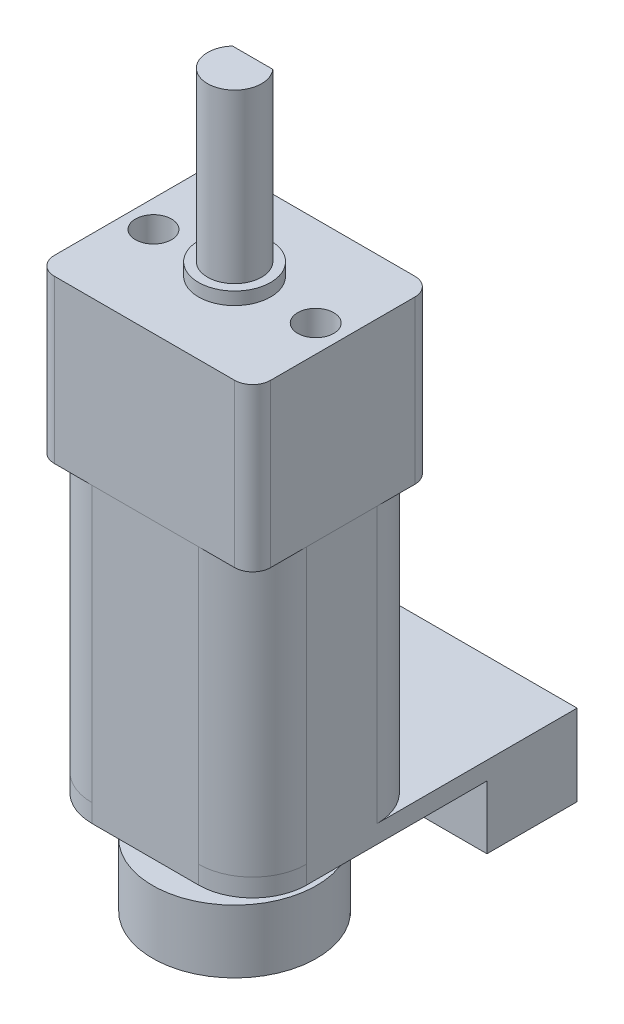
ISO-10303-21;
HEADER;
FILE_DESCRIPTION(('STEP AP214'),'2;1');
FILE_NAME('part.step','',(''),(''),'','','');
FILE_SCHEMA(('AUTOMOTIVE_DESIGN { 1 0 10303 214 1 1 1 1 }'));
ENDSEC;
DATA;
#1=APPLICATION_CONTEXT('core data for automotive mechanical design processes');
#2=APPLICATION_PROTOCOL_DEFINITION('international standard','automotive_design',2000,#1);
#3=PRODUCT_CONTEXT('',#1,'mechanical');
#4=PRODUCT('Part','Part','',(#3));
#5=PRODUCT_RELATED_PRODUCT_CATEGORY('part','',(#4));
#6=PRODUCT_DEFINITION_FORMATION('','',#4);
#7=PRODUCT_DEFINITION_CONTEXT('part definition',#1,'design');
#8=PRODUCT_DEFINITION('design','',#6,#7);
#9=PRODUCT_DEFINITION_SHAPE('','',#8);
#10=(LENGTH_UNIT() NAMED_UNIT(*) SI_UNIT(.MILLI.,.METRE.));
#11=(NAMED_UNIT(*) PLANE_ANGLE_UNIT() SI_UNIT($,.RADIAN.));
#12=(NAMED_UNIT(*) SI_UNIT($,.STERADIAN.) SOLID_ANGLE_UNIT());
#13=UNCERTAINTY_MEASURE_WITH_UNIT(LENGTH_MEASURE(1.E-05),#10,'distance_accuracy_value','');
#14=(GEOMETRIC_REPRESENTATION_CONTEXT(3) GLOBAL_UNCERTAINTY_ASSIGNED_CONTEXT((#13)) GLOBAL_UNIT_ASSIGNED_CONTEXT((#10,
#11,#12)) REPRESENTATION_CONTEXT('',''));
#15=CARTESIAN_POINT('',(0.,0.,0.));
#16=DIRECTION('',(0.,0.,1.));
#17=DIRECTION('',(1.,0.,0.));
#18=AXIS2_PLACEMENT_3D('',#15,#16,#17);
#19=CARTESIAN_POINT('',(0.,-16.3,0.));
#20=DIRECTION('',(0.,-1.,0.));
#21=DIRECTION('',(0.,0.,-1.));
#22=AXIS2_PLACEMENT_3D('',#19,#20,#21);
#23=PLANE('',#22);
#24=CARTESIAN_POINT('',(0.,-16.3,0.));
#25=DIRECTION('',(0.,-1.,0.));
#26=DIRECTION('',(0.,0.,-1.));
#27=AXIS2_PLACEMENT_3D('',#24,#25,#26);
#28=CIRCLE('',#27,0.5);
#29=CARTESIAN_POINT('',(0.,-16.3,-0.5));
#30=VERTEX_POINT('',#29);
#31=EDGE_CURVE('E281',#30,#30,#28,.T.);
#32=ORIENTED_EDGE('',*,*,#31,.F.);
#33=EDGE_LOOP('',(#32));
#34=FACE_BOUND('',#33,.T.);
#35=DIRECTION('',(0.,0.,-1.));
#36=VECTOR('',#35,1.);
#37=CARTESIAN_POINT('',(-5.95,-16.3,-13.05));
#38=LINE('',#37,#36);
#39=CARTESIAN_POINT('',(-5.95,-16.3,1.95));
#40=VERTEX_POINT('',#39);
#41=CARTESIAN_POINT('',(-5.95,-16.3,-8.05));
#42=VERTEX_POINT('',#41);
#43=EDGE_CURVE('E287',#40,#42,#38,.T.);
#44=ORIENTED_EDGE('',*,*,#43,.T.);
#45=DIRECTION('',(-1.,0.,0.));
#46=VECTOR('',#45,1.);
#47=CARTESIAN_POINT('',(5.95,-16.3,-8.05));
#48=LINE('',#47,#46);
#49=CARTESIAN_POINT('',(5.95,-16.3,-8.05));
#50=VERTEX_POINT('',#49);
#51=EDGE_CURVE('E258',#50,#42,#48,.T.);
#52=ORIENTED_EDGE('',*,*,#51,.F.);
#53=DIRECTION('',(0.,0.,1.));
#54=VECTOR('',#53,1.);
#55=CARTESIAN_POINT('',(5.95,-16.3,-13.05));
#56=LINE('',#55,#54);
#57=CARTESIAN_POINT('',(5.95,-16.3,1.95));
#58=VERTEX_POINT('',#57);
#59=EDGE_CURVE('E290',#50,#58,#56,.T.);
#60=ORIENTED_EDGE('',*,*,#59,.T.);
#61=CARTESIAN_POINT('',(2.95,-16.3,1.95));
#62=DIRECTION('',(0.,-1.,0.));
#63=DIRECTION('',(0.,0.,-1.));
#64=AXIS2_PLACEMENT_3D('',#61,#62,#63);
#65=CIRCLE('',#64,3.);
#66=CARTESIAN_POINT('',(2.95,-16.3,4.95));
#67=VERTEX_POINT('',#66);
#68=EDGE_CURVE('E464',#58,#67,#65,.T.);
#69=ORIENTED_EDGE('',*,*,#68,.T.);
#70=DIRECTION('',(-1.,0.,0.));
#71=VECTOR('',#70,1.);
#72=CARTESIAN_POINT('',(5.95,-16.3,4.95));
#73=LINE('',#72,#71);
#74=CARTESIAN_POINT('',(-2.95,-16.3,4.95));
#75=VERTEX_POINT('',#74);
#76=EDGE_CURVE('E293',#67,#75,#73,.T.);
#77=ORIENTED_EDGE('',*,*,#76,.T.);
#78=CARTESIAN_POINT('',(-2.95,-16.3,1.95));
#79=DIRECTION('',(0.,-1.,0.));
#80=DIRECTION('',(0.,0.,-1.));
#81=AXIS2_PLACEMENT_3D('',#78,#79,#80);
#82=CIRCLE('',#81,3.);
#83=EDGE_CURVE('E462',#75,#40,#82,.T.);
#84=ORIENTED_EDGE('',*,*,#83,.T.);
#85=EDGE_LOOP('',(#44,#52,#60,#69,#77,#84));
#86=FACE_BOUND('',#85,.T.);
#87=ADVANCED_FACE('F37',(#34,#86),#23,.T.);
#88=CARTESIAN_POINT('',(0.,-21.5,0.));
#89=DIRECTION('',(0.,1.,0.));
#90=DIRECTION('',(0.,0.,1.));
#91=AXIS2_PLACEMENT_3D('',#88,#89,#90);
#92=CYLINDRICAL_SURFACE('',#91,0.5);
#93=ORIENTED_EDGE('',*,*,#31,.T.);
#94=EDGE_LOOP('',(#93));
#95=FACE_BOUND('',#94,.T.);
#96=CARTESIAN_POINT('',(0.,-18.,0.));
#97=DIRECTION('',(0.,-1.,0.));
#98=DIRECTION('',(0.,0.,-1.));
#99=AXIS2_PLACEMENT_3D('',#96,#97,#98);
#100=CIRCLE('',#99,0.5);
#101=CARTESIAN_POINT('',(0.,-18.,-0.5));
#102=VERTEX_POINT('',#101);
#103=EDGE_CURVE('E12',#102,#102,#100,.T.);
#104=ORIENTED_EDGE('',*,*,#103,.F.);
#105=EDGE_LOOP('',(#104));
#106=FACE_BOUND('',#105,.T.);
#107=ADVANCED_FACE('F539',(#95,#106),#92,.T.);
#108=CARTESIAN_POINT('',(0.,0.,0.));
#109=DIRECTION('',(0.,1.,0.));
#110=DIRECTION('',(0.,0.,1.));
#111=AXIS2_PLACEMENT_3D('',#108,#109,#110);
#112=PLANE('',#111);
#113=CARTESIAN_POINT('',(-5.,0.,4.));
#114=DIRECTION('',(0.,1.,0.));
#115=DIRECTION('',(0.,0.,1.));
#116=AXIS2_PLACEMENT_3D('',#113,#114,#115);
#117=CIRCLE('',#116,1.);
#118=CARTESIAN_POINT('',(-5.,0.,5.));
#119=VERTEX_POINT('',#118);
#120=CARTESIAN_POINT('',(-6.,0.,4.));
#121=VERTEX_POINT('',#120);
#122=EDGE_CURVE('E393',#119,#121,#117,.F.);
#123=ORIENTED_EDGE('',*,*,#122,.T.);
#124=DIRECTION('',(0.,0.,1.));
#125=VECTOR('',#124,1.);
#126=CARTESIAN_POINT('',(-6.,0.,5.));
#127=LINE('',#126,#125);
#128=CARTESIAN_POINT('',(-6.,0.,-4.));
#129=VERTEX_POINT('',#128);
#130=EDGE_CURVE('E352',#129,#121,#127,.T.);
#131=ORIENTED_EDGE('',*,*,#130,.F.);
#132=CARTESIAN_POINT('',(-5.,0.,-4.));
#133=DIRECTION('',(0.,1.,0.));
#134=DIRECTION('',(0.,0.,1.));
#135=AXIS2_PLACEMENT_3D('',#132,#133,#134);
#136=CIRCLE('',#135,1.);
#137=CARTESIAN_POINT('',(-5.,0.,-5.));
#138=VERTEX_POINT('',#137);
#139=EDGE_CURVE('E387',#129,#138,#136,.F.);
#140=ORIENTED_EDGE('',*,*,#139,.T.);
#141=DIRECTION('',(-1.,0.,0.));
#142=VECTOR('',#141,1.);
#143=CARTESIAN_POINT('',(6.,0.,-5.));
#144=LINE('',#143,#142);
#145=CARTESIAN_POINT('',(5.,0.,-5.));
#146=VERTEX_POINT('',#145);
#147=EDGE_CURVE('E365',#146,#138,#144,.T.);
#148=ORIENTED_EDGE('',*,*,#147,.F.);
#149=CARTESIAN_POINT('',(5.,0.,-4.));
#150=DIRECTION('',(0.,1.,0.));
#151=DIRECTION('',(0.,0.,1.));
#152=AXIS2_PLACEMENT_3D('',#149,#150,#151);
#153=CIRCLE('',#152,1.);
#154=CARTESIAN_POINT('',(6.,0.,-4.));
#155=VERTEX_POINT('',#154);
#156=EDGE_CURVE('E389',#146,#155,#153,.F.);
#157=ORIENTED_EDGE('',*,*,#156,.T.);
#158=DIRECTION('',(0.,0.,-1.));
#159=VECTOR('',#158,1.);
#160=CARTESIAN_POINT('',(6.,0.,5.));
#161=LINE('',#160,#159);
#162=CARTESIAN_POINT('',(6.,0.,4.));
#163=VERTEX_POINT('',#162);
#164=EDGE_CURVE('E378',#163,#155,#161,.T.);
#165=ORIENTED_EDGE('',*,*,#164,.F.);
#166=CARTESIAN_POINT('',(5.,0.,4.));
#167=DIRECTION('',(0.,1.,0.));
#168=DIRECTION('',(0.,0.,1.));
#169=AXIS2_PLACEMENT_3D('',#166,#167,#168);
#170=CIRCLE('',#169,1.);
#171=CARTESIAN_POINT('',(5.,0.,5.));
#172=VERTEX_POINT('',#171);
#173=EDGE_CURVE('E391',#163,#172,#170,.F.);
#174=ORIENTED_EDGE('',*,*,#173,.T.);
#175=DIRECTION('',(1.,0.,0.));
#176=VECTOR('',#175,1.);
#177=CARTESIAN_POINT('',(6.,0.,5.));
#178=LINE('',#177,#176);
#179=EDGE_CURVE('E375',#119,#172,#178,.T.);
#180=ORIENTED_EDGE('',*,*,#179,.F.);
#181=EDGE_LOOP('',(#123,#131,#140,#148,#157,#165,#174,#180));
#182=FACE_BOUND('',#181,.T.);
#183=DIRECTION('',(-1.,0.,0.));
#184=VECTOR('',#183,1.);
#185=CARTESIAN_POINT('',(5.95,0.,4.95));
#186=LINE('',#185,#184);
#187=CARTESIAN_POINT('',(2.95,0.,4.95));
#188=VERTEX_POINT('',#187);
#189=CARTESIAN_POINT('',(-2.95,0.,4.95));
#190=VERTEX_POINT('',#189);
#191=EDGE_CURVE('E315',#188,#190,#186,.T.);
#192=ORIENTED_EDGE('',*,*,#191,.F.);
#193=CARTESIAN_POINT('',(2.95,0.,1.95));
#194=DIRECTION('',(0.,1.,0.));
#195=DIRECTION('',(0.,0.,1.));
#196=AXIS2_PLACEMENT_3D('',#193,#194,#195);
#197=CIRCLE('',#196,3.);
#198=CARTESIAN_POINT('',(5.95,0.,1.95));
#199=VERTEX_POINT('',#198);
#200=EDGE_CURVE('E446',#188,#199,#197,.T.);
#201=ORIENTED_EDGE('',*,*,#200,.T.);
#202=DIRECTION('',(0.,0.,1.));
#203=VECTOR('',#202,1.);
#204=CARTESIAN_POINT('',(5.95,0.,-4.95));
#205=LINE('',#204,#203);
#206=CARTESIAN_POINT('',(5.95,0.,-1.95));
#207=VERTEX_POINT('',#206);
#208=EDGE_CURVE('E319',#207,#199,#205,.T.);
#209=ORIENTED_EDGE('',*,*,#208,.F.);
#210=CARTESIAN_POINT('',(2.95,0.,-1.95));
#211=DIRECTION('',(0.,1.,0.));
#212=DIRECTION('',(0.,0.,1.));
#213=AXIS2_PLACEMENT_3D('',#210,#211,#212);
#214=CIRCLE('',#213,3.);
#215=CARTESIAN_POINT('',(2.95,0.,-4.95));
#216=VERTEX_POINT('',#215);
#217=EDGE_CURVE('E448',#207,#216,#214,.T.);
#218=ORIENTED_EDGE('',*,*,#217,.T.);
#219=DIRECTION('',(1.,0.,0.));
#220=VECTOR('',#219,1.);
#221=CARTESIAN_POINT('',(5.95,0.,-4.95));
#222=LINE('',#221,#220);
#223=CARTESIAN_POINT('',(-2.95,0.,-4.95));
#224=VERTEX_POINT('',#223);
#225=EDGE_CURVE('E316',#224,#216,#222,.T.);
#226=ORIENTED_EDGE('',*,*,#225,.F.);
#227=CARTESIAN_POINT('',(-2.95,0.,-1.95));
#228=DIRECTION('',(0.,1.,0.));
#229=DIRECTION('',(0.,0.,1.));
#230=AXIS2_PLACEMENT_3D('',#227,#228,#229);
#231=CIRCLE('',#230,3.);
#232=CARTESIAN_POINT('',(-5.95,0.,-1.95));
#233=VERTEX_POINT('',#232);
#234=EDGE_CURVE('E450',#224,#233,#231,.T.);
#235=ORIENTED_EDGE('',*,*,#234,.T.);
#236=DIRECTION('',(0.,0.,-1.));
#237=VECTOR('',#236,1.);
#238=CARTESIAN_POINT('',(-5.95,0.,-4.95));
#239=LINE('',#238,#237);
#240=CARTESIAN_POINT('',(-5.95,0.,1.95));
#241=VERTEX_POINT('',#240);
#242=EDGE_CURVE('E311',#241,#233,#239,.T.);
#243=ORIENTED_EDGE('',*,*,#242,.F.);
#244=CARTESIAN_POINT('',(-2.95,0.,1.95));
#245=DIRECTION('',(0.,1.,0.));
#246=DIRECTION('',(0.,0.,1.));
#247=AXIS2_PLACEMENT_3D('',#244,#245,#246);
#248=CIRCLE('',#247,3.);
#249=EDGE_CURVE('E452',#241,#190,#248,.T.);
#250=ORIENTED_EDGE('',*,*,#249,.T.);
#251=EDGE_LOOP('',(#192,#201,#209,#218,#226,#235,#243,#250));
#252=FACE_BOUND('',#251,.T.);
#253=ADVANCED_FACE('F481',(#182,#252),#112,.F.);
#254=CARTESIAN_POINT('',(0.,19.,0.));
#255=DIRECTION('',(0.,-1.,0.));
#256=DIRECTION('',(0.,0.,-1.));
#257=AXIS2_PLACEMENT_3D('',#254,#255,#256);
#258=CYLINDRICAL_SURFACE('',#257,1.5);
#259=DIRECTION('',(0.,1.,0.));
#260=VECTOR('',#259,1.);
#261=CARTESIAN_POINT('',(1.1180339887499,9.7,-1.));
#262=LINE('',#261,#260);
#263=CARTESIAN_POINT('',(1.1180339887499,9.7,-1.));
#264=VERTEX_POINT('',#263);
#265=CARTESIAN_POINT('',(1.1180339887499,19.,-1.));
#266=VERTEX_POINT('',#265);
#267=EDGE_CURVE('E327',#264,#266,#262,.T.);
#268=ORIENTED_EDGE('',*,*,#267,.T.);
#269=CARTESIAN_POINT('',(0.,19.,0.));
#270=DIRECTION('',(0.,1.,0.));
#271=DIRECTION('',(0.,0.,1.));
#272=AXIS2_PLACEMENT_3D('',#269,#270,#271);
#273=CIRCLE('',#272,1.5);
#274=CARTESIAN_POINT('',(-1.1180339887499,19.,-1.));
#275=VERTEX_POINT('',#274);
#276=EDGE_CURVE('E332',#275,#266,#273,.T.);
#277=ORIENTED_EDGE('',*,*,#276,.F.);
#278=DIRECTION('',(0.,1.,0.));
#279=VECTOR('',#278,1.);
#280=CARTESIAN_POINT('',(-1.1180339887499,9.7,-1.));
#281=LINE('',#280,#279);
#282=CARTESIAN_POINT('',(-1.1180339887499,9.7,-1.));
#283=VERTEX_POINT('',#282);
#284=EDGE_CURVE('E330',#283,#275,#281,.T.);
#285=ORIENTED_EDGE('',*,*,#284,.F.);
#286=CARTESIAN_POINT('',(0.,9.7,0.));
#287=DIRECTION('',(0.,1.,0.));
#288=DIRECTION('',(0.,0.,1.));
#289=AXIS2_PLACEMENT_3D('',#286,#287,#288);
#290=CIRCLE('',#289,1.5);
#291=EDGE_CURVE('E338',#283,#264,#290,.T.);
#292=ORIENTED_EDGE('',*,*,#291,.T.);
#293=EDGE_LOOP('',(#268,#277,#285,#292));
#294=FACE_BOUND('',#293,.T.);
#295=ADVANCED_FACE('F578',(#294),#258,.T.);
#296=CARTESIAN_POINT('',(0.,19.,0.));
#297=DIRECTION('',(0.,1.,0.));
#298=DIRECTION('',(0.,0.,1.));
#299=AXIS2_PLACEMENT_3D('',#296,#297,#298);
#300=PLANE('',#299);
#301=ORIENTED_EDGE('',*,*,#276,.T.);
#302=DIRECTION('',(-1.,0.,0.));
#303=VECTOR('',#302,1.);
#304=CARTESIAN_POINT('',(-1.1180339887499,19.,-1.));
#305=LINE('',#304,#303);
#306=EDGE_CURVE('E310',#266,#275,#305,.T.);
#307=ORIENTED_EDGE('',*,*,#306,.T.);
#308=EDGE_LOOP('',(#301,#307));
#309=FACE_BOUND('',#308,.T.);
#310=ADVANCED_FACE('F574',(#309),#300,.T.);
#311=CARTESIAN_POINT('',(-6.,9.,5.));
#312=DIRECTION('',(1.,0.,0.));
#313=DIRECTION('',(0.,0.,-1.));
#314=AXIS2_PLACEMENT_3D('',#311,#312,#313);
#315=PLANE('',#314);
#316=ORIENTED_EDGE('',*,*,#130,.T.);
#317=DIRECTION('',(0.,-1.,0.));
#318=VECTOR('',#317,1.);
#319=CARTESIAN_POINT('',(-6.,9.,4.));
#320=LINE('',#319,#318);
#321=CARTESIAN_POINT('',(-6.,9.,4.));
#322=VERTEX_POINT('',#321);
#323=EDGE_CURVE('E398',#121,#322,#320,.F.);
#324=ORIENTED_EDGE('',*,*,#323,.T.);
#325=DIRECTION('',(0.,0.,1.));
#326=VECTOR('',#325,1.);
#327=CARTESIAN_POINT('',(-6.,9.,5.));
#328=LINE('',#327,#326);
#329=CARTESIAN_POINT('',(-6.,9.,-4.));
#330=VERTEX_POINT('',#329);
#331=EDGE_CURVE('E361',#330,#322,#328,.T.);
#332=ORIENTED_EDGE('',*,*,#331,.F.);
#333=DIRECTION('',(0.,-1.,0.));
#334=VECTOR('',#333,1.);
#335=CARTESIAN_POINT('',(-6.,9.,-4.));
#336=LINE('',#335,#334);
#337=EDGE_CURVE('E395',#330,#129,#336,.T.);
#338=ORIENTED_EDGE('',*,*,#337,.T.);
#339=EDGE_LOOP('',(#316,#324,#332,#338));
#340=FACE_BOUND('',#339,.T.);
#341=ADVANCED_FACE('F577',(#340),#315,.F.);
#342=CARTESIAN_POINT('',(6.,9.,5.));
#343=DIRECTION('',(0.,0.,-1.));
#344=DIRECTION('',(-1.,0.,0.));
#345=AXIS2_PLACEMENT_3D('',#342,#343,#344);
#346=PLANE('',#345);
#347=DIRECTION('',(1.,0.,0.));
#348=VECTOR('',#347,1.);
#349=CARTESIAN_POINT('',(6.,9.,5.));
#350=LINE('',#349,#348);
#351=CARTESIAN_POINT('',(-5.,9.,5.));
#352=VERTEX_POINT('',#351);
#353=CARTESIAN_POINT('',(5.,9.,5.));
#354=VERTEX_POINT('',#353);
#355=EDGE_CURVE('E364',#352,#354,#350,.T.);
#356=ORIENTED_EDGE('',*,*,#355,.F.);
#357=DIRECTION('',(0.,-1.,0.));
#358=VECTOR('',#357,1.);
#359=CARTESIAN_POINT('',(-5.,9.,5.));
#360=LINE('',#359,#358);
#361=EDGE_CURVE('E384',#352,#119,#360,.T.);
#362=ORIENTED_EDGE('',*,*,#361,.T.);
#363=ORIENTED_EDGE('',*,*,#179,.T.);
#364=DIRECTION('',(0.,-1.,0.));
#365=VECTOR('',#364,1.);
#366=CARTESIAN_POINT('',(5.,9.,5.));
#367=LINE('',#366,#365);
#368=EDGE_CURVE('E341',#172,#354,#367,.F.);
#369=ORIENTED_EDGE('',*,*,#368,.T.);
#370=EDGE_LOOP('',(#356,#362,#363,#369));
#371=FACE_BOUND('',#370,.T.);
#372=ADVANCED_FACE('F612',(#371),#346,.F.);
#373=CARTESIAN_POINT('',(6.,9.,5.));
#374=DIRECTION('',(-1.,0.,0.));
#375=DIRECTION('',(0.,0.,1.));
#376=AXIS2_PLACEMENT_3D('',#373,#374,#375);
#377=PLANE('',#376);
#378=DIRECTION('',(0.,0.,-1.));
#379=VECTOR('',#378,1.);
#380=CARTESIAN_POINT('',(6.,9.,5.));
#381=LINE('',#380,#379);
#382=CARTESIAN_POINT('',(6.,9.,4.));
#383=VERTEX_POINT('',#382);
#384=CARTESIAN_POINT('',(6.,9.,-4.));
#385=VERTEX_POINT('',#384);
#386=EDGE_CURVE('E368',#383,#385,#381,.T.);
#387=ORIENTED_EDGE('',*,*,#386,.F.);
#388=DIRECTION('',(0.,-1.,0.));
#389=VECTOR('',#388,1.);
#390=CARTESIAN_POINT('',(6.,9.,4.));
#391=LINE('',#390,#389);
#392=EDGE_CURVE('E410',#383,#163,#391,.T.);
#393=ORIENTED_EDGE('',*,*,#392,.T.);
#394=ORIENTED_EDGE('',*,*,#164,.T.);
#395=DIRECTION('',(0.,-1.,0.));
#396=VECTOR('',#395,1.);
#397=CARTESIAN_POINT('',(6.,9.,-4.));
#398=LINE('',#397,#396);
#399=EDGE_CURVE('E408',#155,#385,#398,.F.);
#400=ORIENTED_EDGE('',*,*,#399,.T.);
#401=EDGE_LOOP('',(#387,#393,#394,#400));
#402=FACE_BOUND('',#401,.T.);
#403=ADVANCED_FACE('F608',(#402),#377,.F.);
#404=CARTESIAN_POINT('',(6.,9.,-5.));
#405=DIRECTION('',(0.,0.,1.));
#406=DIRECTION('',(1.,0.,0.));
#407=AXIS2_PLACEMENT_3D('',#404,#405,#406);
#408=PLANE('',#407);
#409=DIRECTION('',(-1.,0.,0.));
#410=VECTOR('',#409,1.);
#411=CARTESIAN_POINT('',(6.,9.,-5.));
#412=LINE('',#411,#410);
#413=CARTESIAN_POINT('',(5.,9.,-5.));
#414=VERTEX_POINT('',#413);
#415=CARTESIAN_POINT('',(-5.,9.,-5.));
#416=VERTEX_POINT('',#415);
#417=EDGE_CURVE('E342',#414,#416,#412,.T.);
#418=ORIENTED_EDGE('',*,*,#417,.F.);
#419=DIRECTION('',(0.,-1.,0.));
#420=VECTOR('',#419,1.);
#421=CARTESIAN_POINT('',(5.,9.,-5.));
#422=LINE('',#421,#420);
#423=EDGE_CURVE('E320',#414,#146,#422,.T.);
#424=ORIENTED_EDGE('',*,*,#423,.T.);
#425=ORIENTED_EDGE('',*,*,#147,.T.);
#426=DIRECTION('',(0.,-1.,0.));
#427=VECTOR('',#426,1.);
#428=CARTESIAN_POINT('',(-5.,9.,-5.));
#429=LINE('',#428,#427);
#430=EDGE_CURVE('E413',#138,#416,#429,.F.);
#431=ORIENTED_EDGE('',*,*,#430,.T.);
#432=EDGE_LOOP('',(#418,#424,#425,#431));
#433=FACE_BOUND('',#432,.T.);
#434=ADVANCED_FACE('F601',(#433),#408,.F.);
#435=CARTESIAN_POINT('',(0.,9.,0.));
#436=DIRECTION('',(0.,1.,0.));
#437=DIRECTION('',(0.,0.,1.));
#438=AXIS2_PLACEMENT_3D('',#435,#436,#437);
#439=PLANE('',#438);
#440=CARTESIAN_POINT('',(0.,9.,0.));
#441=DIRECTION('',(0.,1.,0.));
#442=DIRECTION('',(0.,0.,1.));
#443=AXIS2_PLACEMENT_3D('',#440,#441,#442);
#444=CIRCLE('',#443,2.);
#445=CARTESIAN_POINT('',(0.,9.,2.));
#446=VERTEX_POINT('',#445);
#447=EDGE_CURVE('E337',#446,#446,#444,.T.);
#448=ORIENTED_EDGE('',*,*,#447,.F.);
#449=EDGE_LOOP('',(#448));
#450=FACE_BOUND('',#449,.T.);
#451=CARTESIAN_POINT('',(-4.5,9.,0.));
#452=DIRECTION('',(0.,1.,0.));
#453=DIRECTION('',(0.,0.,1.));
#454=AXIS2_PLACEMENT_3D('',#451,#452,#453);
#455=CIRCLE('',#454,1.);
#456=CARTESIAN_POINT('',(-4.5,9.,1.));
#457=VERTEX_POINT('',#456);
#458=EDGE_CURVE('E353',#457,#457,#455,.T.);
#459=ORIENTED_EDGE('',*,*,#458,.F.);
#460=EDGE_LOOP('',(#459));
#461=FACE_BOUND('',#460,.T.);
#462=CARTESIAN_POINT('',(4.5,9.,0.));
#463=DIRECTION('',(0.,1.,0.));
#464=DIRECTION('',(0.,0.,-1.));
#465=AXIS2_PLACEMENT_3D('',#462,#463,#464);
#466=CIRCLE('',#465,1.);
#467=CARTESIAN_POINT('',(4.5,9.,-1.));
#468=VERTEX_POINT('',#467);
#469=EDGE_CURVE('E346',#468,#468,#466,.T.);
#470=ORIENTED_EDGE('',*,*,#469,.F.);
#471=EDGE_LOOP('',(#470));
#472=FACE_BOUND('',#471,.T.);
#473=ORIENTED_EDGE('',*,*,#331,.T.);
#474=CARTESIAN_POINT('',(-5.,9.,4.));
#475=DIRECTION('',(0.,1.,0.));
#476=DIRECTION('',(0.,0.,1.));
#477=AXIS2_PLACEMENT_3D('',#474,#475,#476);
#478=CIRCLE('',#477,1.);
#479=EDGE_CURVE('E406',#322,#352,#478,.T.);
#480=ORIENTED_EDGE('',*,*,#479,.T.);
#481=ORIENTED_EDGE('',*,*,#355,.T.);
#482=CARTESIAN_POINT('',(5.,9.,4.));
#483=DIRECTION('',(0.,1.,0.));
#484=DIRECTION('',(0.,0.,1.));
#485=AXIS2_PLACEMENT_3D('',#482,#483,#484);
#486=CIRCLE('',#485,1.);
#487=EDGE_CURVE('E404',#354,#383,#486,.T.);
#488=ORIENTED_EDGE('',*,*,#487,.T.);
#489=ORIENTED_EDGE('',*,*,#386,.T.);
#490=CARTESIAN_POINT('',(5.,9.,-4.));
#491=DIRECTION('',(0.,1.,0.));
#492=DIRECTION('',(0.,0.,1.));
#493=AXIS2_PLACEMENT_3D('',#490,#491,#492);
#494=CIRCLE('',#493,1.);
#495=EDGE_CURVE('E402',#385,#414,#494,.T.);
#496=ORIENTED_EDGE('',*,*,#495,.T.);
#497=ORIENTED_EDGE('',*,*,#417,.T.);
#498=CARTESIAN_POINT('',(-5.,9.,-4.));
#499=DIRECTION('',(0.,1.,0.));
#500=DIRECTION('',(0.,0.,1.));
#501=AXIS2_PLACEMENT_3D('',#498,#499,#500);
#502=CIRCLE('',#501,1.);
#503=EDGE_CURVE('E400',#416,#330,#502,.T.);
#504=ORIENTED_EDGE('',*,*,#503,.T.);
#505=EDGE_LOOP('',(#473,#480,#481,#488,#489,#496,#497,#504));
#506=FACE_BOUND('',#505,.T.);
#507=ADVANCED_FACE('F597',(#450,#461,#472,#506),#439,.T.);
#508=CARTESIAN_POINT('',(4.5,0.,0.));
#509=DIRECTION('',(0.,1.,0.));
#510=DIRECTION('',(0.,0.,1.));
#511=AXIS2_PLACEMENT_3D('',#508,#509,#510);
#512=CYLINDRICAL_SURFACE('',#511,1.);
#513=CARTESIAN_POINT('',(4.5,0.,0.));
#514=DIRECTION('',(0.,1.,0.));
#515=DIRECTION('',(0.,0.,-1.));
#516=AXIS2_PLACEMENT_3D('',#513,#514,#515);
#517=CIRCLE('',#516,1.);
#518=CARTESIAN_POINT('',(4.5,0.,-1.));
#519=VERTEX_POINT('',#518);
#520=EDGE_CURVE('E356',#519,#519,#517,.T.);
#521=ORIENTED_EDGE('',*,*,#520,.F.);
#522=EDGE_LOOP('',(#521));
#523=FACE_BOUND('',#522,.T.);
#524=ORIENTED_EDGE('',*,*,#469,.T.);
#525=EDGE_LOOP('',(#524));
#526=FACE_BOUND('',#525,.T.);
#527=ADVANCED_FACE('F593',(#523,#526),#512,.F.);
#528=CARTESIAN_POINT('',(-4.5,0.,0.));
#529=DIRECTION('',(0.,1.,0.));
#530=DIRECTION('',(0.,0.,1.));
#531=AXIS2_PLACEMENT_3D('',#528,#529,#530);
#532=CYLINDRICAL_SURFACE('',#531,1.);
#533=CARTESIAN_POINT('',(-4.5,0.,0.));
#534=DIRECTION('',(0.,1.,0.));
#535=DIRECTION('',(0.,0.,1.));
#536=AXIS2_PLACEMENT_3D('',#533,#534,#535);
#537=CIRCLE('',#536,1.);
#538=CARTESIAN_POINT('',(-4.5,0.,1.));
#539=VERTEX_POINT('',#538);
#540=EDGE_CURVE('E349',#539,#539,#537,.T.);
#541=ORIENTED_EDGE('',*,*,#540,.F.);
#542=EDGE_LOOP('',(#541));
#543=FACE_BOUND('',#542,.T.);
#544=ORIENTED_EDGE('',*,*,#458,.T.);
#545=EDGE_LOOP('',(#544));
#546=FACE_BOUND('',#545,.T.);
#547=ADVANCED_FACE('F589',(#543,#546),#532,.F.);
#548=CARTESIAN_POINT('',(0.,9.7,0.));
#549=DIRECTION('',(0.,-1.,0.));
#550=DIRECTION('',(0.,0.,-1.));
#551=AXIS2_PLACEMENT_3D('',#548,#549,#550);
#552=CYLINDRICAL_SURFACE('',#551,2.);
#553=CARTESIAN_POINT('',(0.,9.7,0.));
#554=DIRECTION('',(0.,1.,0.));
#555=DIRECTION('',(0.,0.,1.));
#556=AXIS2_PLACEMENT_3D('',#553,#554,#555);
#557=CIRCLE('',#556,2.);
#558=CARTESIAN_POINT('',(0.,9.7,2.));
#559=VERTEX_POINT('',#558);
#560=EDGE_CURVE('E343',#559,#559,#557,.T.);
#561=ORIENTED_EDGE('',*,*,#560,.F.);
#562=EDGE_LOOP('',(#561));
#563=FACE_BOUND('',#562,.T.);
#564=ORIENTED_EDGE('',*,*,#447,.T.);
#565=EDGE_LOOP('',(#564));
#566=FACE_BOUND('',#565,.T.);
#567=ADVANCED_FACE('F585',(#563,#566),#552,.T.);
#568=CARTESIAN_POINT('',(0.,9.7,0.));
#569=DIRECTION('',(0.,1.,0.));
#570=DIRECTION('',(0.,0.,1.));
#571=AXIS2_PLACEMENT_3D('',#568,#569,#570);
#572=PLANE('',#571);
#573=ORIENTED_EDGE('',*,*,#291,.F.);
#574=DIRECTION('',(-1.,0.,0.));
#575=VECTOR('',#574,1.);
#576=CARTESIAN_POINT('',(-1.1180339887499,9.7,-1.));
#577=LINE('',#576,#575);
#578=EDGE_CURVE('E325',#264,#283,#577,.T.);
#579=ORIENTED_EDGE('',*,*,#578,.F.);
#580=EDGE_LOOP('',(#573,#579));
#581=FACE_BOUND('',#580,.T.);
#582=ORIENTED_EDGE('',*,*,#560,.T.);
#583=EDGE_LOOP('',(#582));
#584=FACE_BOUND('',#583,.T.);
#585=ADVANCED_FACE('F572',(#581,#584),#572,.T.);
#586=CARTESIAN_POINT('',(-1.1180339887499,9.7,-1.));
#587=DIRECTION('',(0.,0.,-1.));
#588=DIRECTION('',(-1.,0.,0.));
#589=AXIS2_PLACEMENT_3D('',#586,#587,#588);
#590=PLANE('',#589);
#591=ORIENTED_EDGE('',*,*,#306,.F.);
#592=ORIENTED_EDGE('',*,*,#267,.F.);
#593=ORIENTED_EDGE('',*,*,#578,.T.);
#594=ORIENTED_EDGE('',*,*,#284,.T.);
#595=EDGE_LOOP('',(#591,#592,#593,#594));
#596=FACE_BOUND('',#595,.T.);
#597=ADVANCED_FACE('F568',(#596),#590,.T.);
#598=CARTESIAN_POINT('',(-5.,9.,4.));
#599=DIRECTION('',(0.,-1.,0.));
#600=DIRECTION('',(0.,0.,-1.));
#601=AXIS2_PLACEMENT_3D('',#598,#599,#600);
#602=CYLINDRICAL_SURFACE('',#601,1.);
#603=ORIENTED_EDGE('',*,*,#479,.F.);
#604=ORIENTED_EDGE('',*,*,#323,.F.);
#605=ORIENTED_EDGE('',*,*,#122,.F.);
#606=ORIENTED_EDGE('',*,*,#361,.F.);
#607=EDGE_LOOP('',(#603,#604,#605,#606));
#608=FACE_BOUND('',#607,.T.);
#609=ADVANCED_FACE('F571',(#608),#602,.T.);
#610=CARTESIAN_POINT('',(5.,9.,4.));
#611=DIRECTION('',(0.,-1.,0.));
#612=DIRECTION('',(0.,0.,-1.));
#613=AXIS2_PLACEMENT_3D('',#610,#611,#612);
#614=CYLINDRICAL_SURFACE('',#613,1.);
#615=ORIENTED_EDGE('',*,*,#487,.F.);
#616=ORIENTED_EDGE('',*,*,#368,.F.);
#617=ORIENTED_EDGE('',*,*,#173,.F.);
#618=ORIENTED_EDGE('',*,*,#392,.F.);
#619=EDGE_LOOP('',(#615,#616,#617,#618));
#620=FACE_BOUND('',#619,.T.);
#621=ADVANCED_FACE('F622',(#620),#614,.T.);
#622=CARTESIAN_POINT('',(5.,9.,-4.));
#623=DIRECTION('',(0.,-1.,0.));
#624=DIRECTION('',(0.,0.,-1.));
#625=AXIS2_PLACEMENT_3D('',#622,#623,#624);
#626=CYLINDRICAL_SURFACE('',#625,1.);
#627=ORIENTED_EDGE('',*,*,#495,.F.);
#628=ORIENTED_EDGE('',*,*,#399,.F.);
#629=ORIENTED_EDGE('',*,*,#156,.F.);
#630=ORIENTED_EDGE('',*,*,#423,.F.);
#631=EDGE_LOOP('',(#627,#628,#629,#630));
#632=FACE_BOUND('',#631,.T.);
#633=ADVANCED_FACE('F626',(#632),#626,.T.);
#634=CARTESIAN_POINT('',(-5.,9.,-4.));
#635=DIRECTION('',(0.,-1.,0.));
#636=DIRECTION('',(0.,0.,-1.));
#637=AXIS2_PLACEMENT_3D('',#634,#635,#636);
#638=CYLINDRICAL_SURFACE('',#637,1.);
#639=ORIENTED_EDGE('',*,*,#503,.F.);
#640=ORIENTED_EDGE('',*,*,#430,.F.);
#641=ORIENTED_EDGE('',*,*,#139,.F.);
#642=ORIENTED_EDGE('',*,*,#337,.F.);
#643=EDGE_LOOP('',(#639,#640,#641,#642));
#644=FACE_BOUND('',#643,.T.);
#645=ADVANCED_FACE('F561',(#644),#638,.T.);
#646=CARTESIAN_POINT('',(5.95,-15.3,4.95));
#647=DIRECTION('',(0.,0.,-1.));
#648=DIRECTION('',(-1.,0.,0.));
#649=AXIS2_PLACEMENT_3D('',#646,#647,#648);
#650=PLANE('',#649);
#651=ORIENTED_EDGE('',*,*,#76,.F.);
#652=DIRECTION('',(0.,1.,0.));
#653=VECTOR('',#652,1.);
#654=CARTESIAN_POINT('',(2.95,-15.3,4.95));
#655=LINE('',#654,#653);
#656=CARTESIAN_POINT('',(2.95,-15.3,4.95));
#657=VERTEX_POINT('',#656);
#658=EDGE_CURVE('E456',#67,#657,#655,.T.);
#659=ORIENTED_EDGE('',*,*,#658,.T.);
#660=DIRECTION('',(0.,1.,0.));
#661=VECTOR('',#660,1.);
#662=CARTESIAN_POINT('',(2.95,-15.3,4.95));
#663=LINE('',#662,#661);
#664=EDGE_CURVE('E418',#657,#188,#663,.T.);
#665=ORIENTED_EDGE('',*,*,#664,.T.);
#666=ORIENTED_EDGE('',*,*,#191,.T.);
#667=DIRECTION('',(0.,1.,0.));
#668=VECTOR('',#667,1.);
#669=CARTESIAN_POINT('',(-2.95,-15.3,4.95));
#670=LINE('',#669,#668);
#671=CARTESIAN_POINT('',(-2.95,-15.3,4.95));
#672=VERTEX_POINT('',#671);
#673=EDGE_CURVE('E314',#190,#672,#670,.F.);
#674=ORIENTED_EDGE('',*,*,#673,.T.);
#675=DIRECTION('',(0.,1.,0.));
#676=VECTOR('',#675,1.);
#677=CARTESIAN_POINT('',(-2.95,-15.3,4.95));
#678=LINE('',#677,#676);
#679=EDGE_CURVE('E454',#672,#75,#678,.F.);
#680=ORIENTED_EDGE('',*,*,#679,.T.);
#681=EDGE_LOOP('',(#651,#659,#665,#666,#674,#680));
#682=FACE_BOUND('',#681,.T.);
#683=ADVANCED_FACE('F484',(#682),#650,.F.);
#684=CARTESIAN_POINT('',(5.95,-15.3,-4.95));
#685=DIRECTION('',(-1.,0.,0.));
#686=DIRECTION('',(0.,0.,1.));
#687=AXIS2_PLACEMENT_3D('',#684,#685,#686);
#688=PLANE('',#687);
#689=DIRECTION('',(0.,1.,0.));
#690=VECTOR('',#689,1.);
#691=CARTESIAN_POINT('',(5.95,-15.3,1.95));
#692=LINE('',#691,#690);
#693=CARTESIAN_POINT('',(5.95,-15.3,1.95));
#694=VERTEX_POINT('',#693);
#695=EDGE_CURVE('E424',#199,#694,#692,.F.);
#696=ORIENTED_EDGE('',*,*,#695,.T.);
#697=DIRECTION('',(0.,1.,0.));
#698=VECTOR('',#697,1.);
#699=CARTESIAN_POINT('',(5.95,-15.3,1.95));
#700=LINE('',#699,#698);
#701=EDGE_CURVE('E459',#694,#58,#700,.F.);
#702=ORIENTED_EDGE('',*,*,#701,.T.);
#703=ORIENTED_EDGE('',*,*,#59,.F.);
#704=DIRECTION('',(0.,1.,0.));
#705=VECTOR('',#704,1.);
#706=CARTESIAN_POINT('',(5.95,-19.8,-8.05));
#707=LINE('',#706,#705);
#708=CARTESIAN_POINT('',(5.95,-19.8,-8.05));
#709=VERTEX_POINT('',#708);
#710=EDGE_CURVE('E60',#709,#50,#707,.T.);
#711=ORIENTED_EDGE('',*,*,#710,.F.);
#712=DIRECTION('',(0.,0.,1.));
#713=VECTOR('',#712,1.);
#714=CARTESIAN_POINT('',(5.95,-19.8,-13.05));
#715=LINE('',#714,#713);
#716=CARTESIAN_POINT('',(5.95,-19.8,-13.05));
#717=VERTEX_POINT('',#716);
#718=EDGE_CURVE('E268',#717,#709,#715,.T.);
#719=ORIENTED_EDGE('',*,*,#718,.F.);
#720=DIRECTION('',(0.,1.,0.));
#721=VECTOR('',#720,1.);
#722=CARTESIAN_POINT('',(5.95,-16.3,-13.05));
#723=LINE('',#722,#721);
#724=CARTESIAN_POINT('',(5.95,-15.3,-13.05));
#725=VERTEX_POINT('',#724);
#726=EDGE_CURVE('E296',#717,#725,#723,.T.);
#727=ORIENTED_EDGE('',*,*,#726,.T.);
#728=DIRECTION('',(0.,0.,1.));
#729=VECTOR('',#728,1.);
#730=CARTESIAN_POINT('',(5.95,-15.3,-13.05));
#731=LINE('',#730,#729);
#732=CARTESIAN_POINT('',(5.95,-15.3,-1.95));
#733=VERTEX_POINT('',#732);
#734=EDGE_CURVE('E291',#725,#733,#731,.T.);
#735=ORIENTED_EDGE('',*,*,#734,.T.);
#736=DIRECTION('',(0.,1.,0.));
#737=VECTOR('',#736,1.);
#738=CARTESIAN_POINT('',(5.95,-15.3,-1.95));
#739=LINE('',#738,#737);
#740=EDGE_CURVE('E421',#733,#207,#739,.T.);
#741=ORIENTED_EDGE('',*,*,#740,.T.);
#742=ORIENTED_EDGE('',*,*,#208,.T.);
#743=EDGE_LOOP('',(#696,#702,#703,#711,#719,#727,#735,#741,#742));
#744=FACE_BOUND('',#743,.T.);
#745=ADVANCED_FACE('F494',(#744),#688,.F.);
#746=CARTESIAN_POINT('',(5.95,-15.3,-4.95));
#747=DIRECTION('',(0.,0.,1.));
#748=DIRECTION('',(1.,0.,0.));
#749=AXIS2_PLACEMENT_3D('',#746,#747,#748);
#750=PLANE('',#749);
#751=ORIENTED_EDGE('',*,*,#225,.T.);
#752=DIRECTION('',(0.,1.,0.));
#753=VECTOR('',#752,1.);
#754=CARTESIAN_POINT('',(2.95,-15.3,-4.95));
#755=LINE('',#754,#753);
#756=CARTESIAN_POINT('',(2.95,-15.3,-4.95));
#757=VERTEX_POINT('',#756);
#758=EDGE_CURVE('E439',#216,#757,#755,.F.);
#759=ORIENTED_EDGE('',*,*,#758,.T.);
#760=DIRECTION('',(1.,0.,0.));
#761=VECTOR('',#760,1.);
#762=CARTESIAN_POINT('',(5.95,-15.3,-4.95));
#763=LINE('',#762,#761);
#764=CARTESIAN_POINT('',(-2.95,-15.3,-4.95));
#765=VERTEX_POINT('',#764);
#766=EDGE_CURVE('E307',#765,#757,#763,.T.);
#767=ORIENTED_EDGE('',*,*,#766,.F.);
#768=DIRECTION('',(0.,1.,0.));
#769=VECTOR('',#768,1.);
#770=CARTESIAN_POINT('',(-2.95,-15.3,-4.95));
#771=LINE('',#770,#769);
#772=EDGE_CURVE('E436',#765,#224,#771,.T.);
#773=ORIENTED_EDGE('',*,*,#772,.T.);
#774=EDGE_LOOP('',(#751,#759,#767,#773));
#775=FACE_BOUND('',#774,.T.);
#776=ADVANCED_FACE('F507',(#775),#750,.F.);
#777=CARTESIAN_POINT('',(-5.95,-15.3,-4.95));
#778=DIRECTION('',(1.,0.,0.));
#779=DIRECTION('',(0.,0.,-1.));
#780=AXIS2_PLACEMENT_3D('',#777,#778,#779);
#781=PLANE('',#780);
#782=ORIENTED_EDGE('',*,*,#43,.F.);
#783=DIRECTION('',(0.,1.,0.));
#784=VECTOR('',#783,1.);
#785=CARTESIAN_POINT('',(-5.95,-15.3,1.95));
#786=LINE('',#785,#784);
#787=CARTESIAN_POINT('',(-5.95,-15.3,1.95));
#788=VERTEX_POINT('',#787);
#789=EDGE_CURVE('E45',#40,#788,#786,.T.);
#790=ORIENTED_EDGE('',*,*,#789,.T.);
#791=DIRECTION('',(0.,1.,0.));
#792=VECTOR('',#791,1.);
#793=CARTESIAN_POINT('',(-5.95,-15.3,1.95));
#794=LINE('',#793,#792);
#795=EDGE_CURVE('E441',#788,#241,#794,.T.);
#796=ORIENTED_EDGE('',*,*,#795,.T.);
#797=ORIENTED_EDGE('',*,*,#242,.T.);
#798=DIRECTION('',(0.,1.,0.));
#799=VECTOR('',#798,1.);
#800=CARTESIAN_POINT('',(-5.95,-15.3,-1.95));
#801=LINE('',#800,#799);
#802=CARTESIAN_POINT('',(-5.95,-15.3,-1.95));
#803=VERTEX_POINT('',#802);
#804=EDGE_CURVE('E444',#233,#803,#801,.F.);
#805=ORIENTED_EDGE('',*,*,#804,.T.);
#806=DIRECTION('',(0.,0.,-1.));
#807=VECTOR('',#806,1.);
#808=CARTESIAN_POINT('',(-5.95,-15.3,-13.05));
#809=LINE('',#808,#807);
#810=CARTESIAN_POINT('',(-5.95,-15.3,-13.05));
#811=VERTEX_POINT('',#810);
#812=EDGE_CURVE('E286',#803,#811,#809,.T.);
#813=ORIENTED_EDGE('',*,*,#812,.T.);
#814=DIRECTION('',(0.,1.,0.));
#815=VECTOR('',#814,1.);
#816=CARTESIAN_POINT('',(-5.95,-16.3,-13.05));
#817=LINE('',#816,#815);
#818=CARTESIAN_POINT('',(-5.95,-19.8,-13.05));
#819=VERTEX_POINT('',#818);
#820=EDGE_CURVE('E304',#819,#811,#817,.T.);
#821=ORIENTED_EDGE('',*,*,#820,.F.);
#822=DIRECTION('',(0.,0.,-1.));
#823=VECTOR('',#822,1.);
#824=CARTESIAN_POINT('',(-5.95,-19.8,-13.05));
#825=LINE('',#824,#823);
#826=CARTESIAN_POINT('',(-5.95,-19.8,-8.05));
#827=VERTEX_POINT('',#826);
#828=EDGE_CURVE('E262',#827,#819,#825,.T.);
#829=ORIENTED_EDGE('',*,*,#828,.F.);
#830=DIRECTION('',(0.,1.,0.));
#831=VECTOR('',#830,1.);
#832=CARTESIAN_POINT('',(-5.95,-19.8,-8.05));
#833=LINE('',#832,#831);
#834=EDGE_CURVE('E272',#827,#42,#833,.T.);
#835=ORIENTED_EDGE('',*,*,#834,.T.);
#836=EDGE_LOOP('',(#782,#790,#796,#797,#805,#813,#821,#829,#835));
#837=FACE_BOUND('',#836,.T.);
#838=ADVANCED_FACE('F470',(#837),#781,.F.);
#839=CARTESIAN_POINT('',(0.,0.,0.));
#840=DIRECTION('',(0.,-1.,0.));
#841=DIRECTION('',(0.,0.,-1.));
#842=AXIS2_PLACEMENT_3D('',#839,#840,#841);
#843=PLANE('',#842);
#844=ORIENTED_EDGE('',*,*,#520,.T.);
#845=EDGE_LOOP('',(#844));
#846=FACE_BOUND('',#845,.T.);
#847=ADVANCED_FACE('F557',(#846),#843,.F.);
#848=ORIENTED_EDGE('',*,*,#540,.T.);
#849=EDGE_LOOP('',(#848));
#850=FACE_BOUND('',#849,.T.);
#851=ADVANCED_FACE('F554',(#850),#843,.F.);
#852=CARTESIAN_POINT('',(2.95,-15.3,1.95));
#853=DIRECTION('',(0.,1.,0.));
#854=DIRECTION('',(0.,0.,1.));
#855=AXIS2_PLACEMENT_3D('',#852,#853,#854);
#856=CYLINDRICAL_SURFACE('',#855,3.);
#857=CARTESIAN_POINT('',(2.95,-15.3,1.95));
#858=DIRECTION('',(0.,-1.,0.));
#859=DIRECTION('',(0.,0.,-1.));
#860=AXIS2_PLACEMENT_3D('',#857,#858,#859);
#861=CIRCLE('',#860,3.);
#862=EDGE_CURVE('E434',#694,#657,#861,.T.);
#863=ORIENTED_EDGE('',*,*,#862,.F.);
#864=ORIENTED_EDGE('',*,*,#695,.F.);
#865=ORIENTED_EDGE('',*,*,#200,.F.);
#866=ORIENTED_EDGE('',*,*,#664,.F.);
#867=EDGE_LOOP('',(#863,#864,#865,#866));
#868=FACE_BOUND('',#867,.T.);
#869=ADVANCED_FACE('F489',(#868),#856,.T.);
#870=CARTESIAN_POINT('',(2.95,-15.3,-1.95));
#871=DIRECTION('',(0.,1.,0.));
#872=DIRECTION('',(0.,0.,1.));
#873=AXIS2_PLACEMENT_3D('',#870,#871,#872);
#874=CYLINDRICAL_SURFACE('',#873,3.);
#875=CARTESIAN_POINT('',(2.95,-15.3,-1.95));
#876=DIRECTION('',(0.,-1.,0.));
#877=DIRECTION('',(0.,0.,-1.));
#878=AXIS2_PLACEMENT_3D('',#875,#876,#877);
#879=CIRCLE('',#878,3.);
#880=EDGE_CURVE('E431',#757,#733,#879,.T.);
#881=ORIENTED_EDGE('',*,*,#880,.F.);
#882=ORIENTED_EDGE('',*,*,#758,.F.);
#883=ORIENTED_EDGE('',*,*,#217,.F.);
#884=ORIENTED_EDGE('',*,*,#740,.F.);
#885=EDGE_LOOP('',(#881,#882,#883,#884));
#886=FACE_BOUND('',#885,.T.);
#887=ADVANCED_FACE('F498',(#886),#874,.T.);
#888=CARTESIAN_POINT('',(-2.95,-15.3,-1.95));
#889=DIRECTION('',(0.,1.,0.));
#890=DIRECTION('',(0.,0.,1.));
#891=AXIS2_PLACEMENT_3D('',#888,#889,#890);
#892=CYLINDRICAL_SURFACE('',#891,3.);
#893=CARTESIAN_POINT('',(-2.95,-15.3,-1.95));
#894=DIRECTION('',(0.,-1.,0.));
#895=DIRECTION('',(0.,0.,-1.));
#896=AXIS2_PLACEMENT_3D('',#893,#894,#895);
#897=CIRCLE('',#896,3.);
#898=EDGE_CURVE('E428',#803,#765,#897,.T.);
#899=ORIENTED_EDGE('',*,*,#898,.F.);
#900=ORIENTED_EDGE('',*,*,#804,.F.);
#901=ORIENTED_EDGE('',*,*,#234,.F.);
#902=ORIENTED_EDGE('',*,*,#772,.F.);
#903=EDGE_LOOP('',(#899,#900,#901,#902));
#904=FACE_BOUND('',#903,.T.);
#905=ADVANCED_FACE('F510',(#904),#892,.T.);
#906=CARTESIAN_POINT('',(-2.95,-15.3,1.95));
#907=DIRECTION('',(0.,1.,0.));
#908=DIRECTION('',(0.,0.,1.));
#909=AXIS2_PLACEMENT_3D('',#906,#907,#908);
#910=CYLINDRICAL_SURFACE('',#909,3.);
#911=CARTESIAN_POINT('',(-2.95,-15.3,1.95));
#912=DIRECTION('',(0.,-1.,0.));
#913=DIRECTION('',(0.,0.,-1.));
#914=AXIS2_PLACEMENT_3D('',#911,#912,#913);
#915=CIRCLE('',#914,3.);
#916=EDGE_CURVE('E426',#672,#788,#915,.T.);
#917=ORIENTED_EDGE('',*,*,#916,.F.);
#918=ORIENTED_EDGE('',*,*,#673,.F.);
#919=ORIENTED_EDGE('',*,*,#249,.F.);
#920=ORIENTED_EDGE('',*,*,#795,.F.);
#921=EDGE_LOOP('',(#917,#918,#919,#920));
#922=FACE_BOUND('',#921,.T.);
#923=ADVANCED_FACE('F476',(#922),#910,.T.);
#924=CARTESIAN_POINT('',(5.95,-16.3,-13.05));
#925=DIRECTION('',(0.,0.,1.));
#926=DIRECTION('',(1.,0.,0.));
#927=AXIS2_PLACEMENT_3D('',#924,#925,#926);
#928=PLANE('',#927);
#929=DIRECTION('',(-1.,0.,0.));
#930=VECTOR('',#929,1.);
#931=CARTESIAN_POINT('',(-5.5,-19.55,-13.05));
#932=LINE('',#931,#930);
#933=CARTESIAN_POINT('',(5.5,-19.55,-13.05));
#934=VERTEX_POINT('',#933);
#935=CARTESIAN_POINT('',(-5.5,-19.55,-13.05));
#936=VERTEX_POINT('',#935);
#937=EDGE_CURVE('E252',#934,#936,#932,.T.);
#938=ORIENTED_EDGE('',*,*,#937,.F.);
#939=DIRECTION('',(0.,-1.,0.));
#940=VECTOR('',#939,1.);
#941=CARTESIAN_POINT('',(5.5,-19.55,-13.05));
#942=LINE('',#941,#940);
#943=CARTESIAN_POINT('',(5.5,-15.55,-13.05));
#944=VERTEX_POINT('',#943);
#945=EDGE_CURVE('E52',#944,#934,#942,.T.);
#946=ORIENTED_EDGE('',*,*,#945,.F.);
#947=DIRECTION('',(1.,0.,0.));
#948=VECTOR('',#947,1.);
#949=CARTESIAN_POINT('',(-5.5,-15.55,-13.05));
#950=LINE('',#949,#948);
#951=CARTESIAN_POINT('',(-5.5,-15.55,-13.05));
#952=VERTEX_POINT('',#951);
#953=EDGE_CURVE('E243',#952,#944,#950,.T.);
#954=ORIENTED_EDGE('',*,*,#953,.F.);
#955=DIRECTION('',(0.,1.,0.));
#956=VECTOR('',#955,1.);
#957=CARTESIAN_POINT('',(-5.5,-19.55,-13.05));
#958=LINE('',#957,#956);
#959=EDGE_CURVE('E246',#936,#952,#958,.T.);
#960=ORIENTED_EDGE('',*,*,#959,.F.);
#961=EDGE_LOOP('',(#938,#946,#954,#960));
#962=FACE_BOUND('',#961,.T.);
#963=DIRECTION('',(1.,0.,0.));
#964=VECTOR('',#963,1.);
#965=CARTESIAN_POINT('',(5.95,-15.3,-13.05));
#966=LINE('',#965,#964);
#967=EDGE_CURVE('E298',#811,#725,#966,.T.);
#968=ORIENTED_EDGE('',*,*,#967,.T.);
#969=ORIENTED_EDGE('',*,*,#726,.F.);
#970=DIRECTION('',(1.,0.,0.));
#971=VECTOR('',#970,1.);
#972=CARTESIAN_POINT('',(5.95,-19.8,-13.05));
#973=LINE('',#972,#971);
#974=EDGE_CURVE('E265',#819,#717,#973,.T.);
#975=ORIENTED_EDGE('',*,*,#974,.F.);
#976=ORIENTED_EDGE('',*,*,#820,.T.);
#977=EDGE_LOOP('',(#968,#969,#975,#976));
#978=FACE_BOUND('',#977,.T.);
#979=ADVANCED_FACE('F515',(#962,#978),#928,.F.);
#980=CARTESIAN_POINT('',(0.,-15.3,0.));
#981=DIRECTION('',(0.,-1.,0.));
#982=DIRECTION('',(0.,0.,-1.));
#983=AXIS2_PLACEMENT_3D('',#980,#981,#982);
#984=PLANE('',#983);
#985=ORIENTED_EDGE('',*,*,#812,.F.);
#986=ORIENTED_EDGE('',*,*,#898,.T.);
#987=ORIENTED_EDGE('',*,*,#766,.T.);
#988=ORIENTED_EDGE('',*,*,#880,.T.);
#989=ORIENTED_EDGE('',*,*,#734,.F.);
#990=ORIENTED_EDGE('',*,*,#967,.F.);
#991=EDGE_LOOP('',(#985,#986,#987,#988,#989,#990));
#992=FACE_BOUND('',#991,.T.);
#993=ADVANCED_FACE('F502',(#992),#984,.F.);
#994=CARTESIAN_POINT('',(2.95,-15.3,1.95));
#995=DIRECTION('',(0.,1.,0.));
#996=DIRECTION('',(0.,0.,1.));
#997=AXIS2_PLACEMENT_3D('',#994,#995,#996);
#998=CYLINDRICAL_SURFACE('',#997,3.);
#999=ORIENTED_EDGE('',*,*,#68,.F.);
#1000=ORIENTED_EDGE('',*,*,#701,.F.);
#1001=ORIENTED_EDGE('',*,*,#862,.T.);
#1002=ORIENTED_EDGE('',*,*,#658,.F.);
#1003=EDGE_LOOP('',(#999,#1000,#1001,#1002));
#1004=FACE_BOUND('',#1003,.T.);
#1005=ADVANCED_FACE('F524',(#1004),#998,.T.);
#1006=CARTESIAN_POINT('',(-2.95,-15.3,1.95));
#1007=DIRECTION('',(0.,1.,0.));
#1008=DIRECTION('',(0.,0.,1.));
#1009=AXIS2_PLACEMENT_3D('',#1006,#1007,#1008);
#1010=CYLINDRICAL_SURFACE('',#1009,3.);
#1011=ORIENTED_EDGE('',*,*,#83,.F.);
#1012=ORIENTED_EDGE('',*,*,#679,.F.);
#1013=ORIENTED_EDGE('',*,*,#916,.T.);
#1014=ORIENTED_EDGE('',*,*,#789,.F.);
#1015=EDGE_LOOP('',(#1011,#1012,#1013,#1014));
#1016=FACE_BOUND('',#1015,.T.);
#1017=ADVANCED_FACE('F39',(#1016),#1010,.T.);
#1018=CARTESIAN_POINT('',(0.,-18.,0.));
#1019=DIRECTION('',(0.,-1.,0.));
#1020=DIRECTION('',(0.,0.,-1.));
#1021=AXIS2_PLACEMENT_3D('',#1018,#1019,#1020);
#1022=CYLINDRICAL_SURFACE('',#1021,4.55);
#1023=CARTESIAN_POINT('',(0.,-18.,0.));
#1024=DIRECTION('',(0.,-1.,0.));
#1025=DIRECTION('',(0.,0.,-1.));
#1026=AXIS2_PLACEMENT_3D('',#1023,#1024,#1025);
#1027=CIRCLE('',#1026,4.55);
#1028=CARTESIAN_POINT('',(0.,-18.,-4.55));
#1029=VERTEX_POINT('',#1028);
#1030=EDGE_CURVE('E278',#1029,#1029,#1027,.T.);
#1031=ORIENTED_EDGE('',*,*,#1030,.T.);
#1032=EDGE_LOOP('',(#1031));
#1033=FACE_BOUND('',#1032,.T.);
#1034=CARTESIAN_POINT('',(0.,-21.5,0.));
#1035=DIRECTION('',(0.,-1.,0.));
#1036=DIRECTION('',(0.,0.,-1.));
#1037=AXIS2_PLACEMENT_3D('',#1034,#1035,#1036);
#1038=CIRCLE('',#1037,4.55);
#1039=CARTESIAN_POINT('',(0.,-21.5,-4.55));
#1040=VERTEX_POINT('',#1039);
#1041=EDGE_CURVE('E277',#1040,#1040,#1038,.T.);
#1042=ORIENTED_EDGE('',*,*,#1041,.F.);
#1043=EDGE_LOOP('',(#1042));
#1044=FACE_BOUND('',#1043,.T.);
#1045=ADVANCED_FACE('F645',(#1033,#1044),#1022,.T.);
#1046=CARTESIAN_POINT('',(0.,-18.,0.));
#1047=DIRECTION('',(0.,-1.,0.));
#1048=DIRECTION('',(0.,0.,-1.));
#1049=AXIS2_PLACEMENT_3D('',#1046,#1047,#1048);
#1050=PLANE('',#1049);
#1051=ORIENTED_EDGE('',*,*,#103,.T.);
#1052=EDGE_LOOP('',(#1051));
#1053=FACE_BOUND('',#1052,.T.);
#1054=ORIENTED_EDGE('',*,*,#1030,.F.);
#1055=EDGE_LOOP('',(#1054));
#1056=FACE_BOUND('',#1055,.T.);
#1057=ADVANCED_FACE('F534',(#1053,#1056),#1050,.F.);
#1058=CARTESIAN_POINT('',(0.,-21.5,0.));
#1059=DIRECTION('',(0.,-1.,0.));
#1060=DIRECTION('',(0.,0.,-1.));
#1061=AXIS2_PLACEMENT_3D('',#1058,#1059,#1060);
#1062=PLANE('',#1061);
#1063=ORIENTED_EDGE('',*,*,#1041,.T.);
#1064=EDGE_LOOP('',(#1063));
#1065=FACE_BOUND('',#1064,.T.);
#1066=ADVANCED_FACE('F527',(#1065),#1062,.T.);
#1067=CARTESIAN_POINT('',(5.95,-19.8,-8.05));
#1068=DIRECTION('',(0.,0.,-1.));
#1069=DIRECTION('',(-1.,0.,0.));
#1070=AXIS2_PLACEMENT_3D('',#1067,#1068,#1069);
#1071=PLANE('',#1070);
#1072=ORIENTED_EDGE('',*,*,#51,.T.);
#1073=ORIENTED_EDGE('',*,*,#834,.F.);
#1074=DIRECTION('',(-1.,0.,0.));
#1075=VECTOR('',#1074,1.);
#1076=CARTESIAN_POINT('',(5.95,-19.8,-8.05));
#1077=LINE('',#1076,#1075);
#1078=EDGE_CURVE('E270',#709,#827,#1077,.T.);
#1079=ORIENTED_EDGE('',*,*,#1078,.F.);
#1080=ORIENTED_EDGE('',*,*,#710,.T.);
#1081=EDGE_LOOP('',(#1072,#1073,#1079,#1080));
#1082=FACE_BOUND('',#1081,.T.);
#1083=ADVANCED_FACE('F525',(#1082),#1071,.F.);
#1084=CARTESIAN_POINT('',(0.,-19.8,0.));
#1085=DIRECTION('',(0.,-1.,0.));
#1086=DIRECTION('',(0.,0.,-1.));
#1087=AXIS2_PLACEMENT_3D('',#1084,#1085,#1086);
#1088=PLANE('',#1087);
#1089=ORIENTED_EDGE('',*,*,#828,.T.);
#1090=ORIENTED_EDGE('',*,*,#974,.T.);
#1091=ORIENTED_EDGE('',*,*,#718,.T.);
#1092=ORIENTED_EDGE('',*,*,#1078,.T.);
#1093=EDGE_LOOP('',(#1089,#1090,#1091,#1092));
#1094=FACE_BOUND('',#1093,.T.);
#1095=ADVANCED_FACE('F518',(#1094),#1088,.T.);
#1096=CARTESIAN_POINT('',(5.5,-19.55,-10.05));
#1097=DIRECTION('',(1.,0.,0.));
#1098=DIRECTION('',(0.,0.,-1.));
#1099=AXIS2_PLACEMENT_3D('',#1096,#1097,#1098);
#1100=PLANE('',#1099);
#1101=ORIENTED_EDGE('',*,*,#945,.T.);
#1102=DIRECTION('',(0.,0.,-1.));
#1103=VECTOR('',#1102,1.);
#1104=CARTESIAN_POINT('',(5.5,-19.55,-10.05));
#1105=LINE('',#1104,#1103);
#1106=CARTESIAN_POINT('',(5.5,-19.55,-10.05));
#1107=VERTEX_POINT('',#1106);
#1108=EDGE_CURVE('E221',#1107,#934,#1105,.T.);
#1109=ORIENTED_EDGE('',*,*,#1108,.F.);
#1110=DIRECTION('',(0.,-1.,0.));
#1111=VECTOR('',#1110,1.);
#1112=CARTESIAN_POINT('',(5.5,-19.55,-10.05));
#1113=LINE('',#1112,#1111);
#1114=CARTESIAN_POINT('',(5.5,-15.55,-10.05));
#1115=VERTEX_POINT('',#1114);
#1116=EDGE_CURVE('E225',#1115,#1107,#1113,.T.);
#1117=ORIENTED_EDGE('',*,*,#1116,.F.);
#1118=DIRECTION('',(0.,0.,-1.));
#1119=VECTOR('',#1118,1.);
#1120=CARTESIAN_POINT('',(5.5,-15.55,-10.05));
#1121=LINE('',#1120,#1119);
#1122=EDGE_CURVE('E256',#1115,#944,#1121,.T.);
#1123=ORIENTED_EDGE('',*,*,#1122,.T.);
#1124=EDGE_LOOP('',(#1101,#1109,#1117,#1123));
#1125=FACE_BOUND('',#1124,.T.);
#1126=ADVANCED_FACE('F223',(#1125),#1100,.F.);
#1127=CARTESIAN_POINT('',(-5.5,-15.55,-10.05));
#1128=DIRECTION('',(0.,1.,0.));
#1129=DIRECTION('',(0.,0.,1.));
#1130=AXIS2_PLACEMENT_3D('',#1127,#1128,#1129);
#1131=PLANE('',#1130);
#1132=ORIENTED_EDGE('',*,*,#953,.T.);
#1133=ORIENTED_EDGE('',*,*,#1122,.F.);
#1134=DIRECTION('',(1.,0.,0.));
#1135=VECTOR('',#1134,1.);
#1136=CARTESIAN_POINT('',(-5.5,-15.55,-10.05));
#1137=LINE('',#1136,#1135);
#1138=CARTESIAN_POINT('',(-5.5,-15.55,-10.05));
#1139=VERTEX_POINT('',#1138);
#1140=EDGE_CURVE('E231',#1139,#1115,#1137,.T.);
#1141=ORIENTED_EDGE('',*,*,#1140,.F.);
#1142=DIRECTION('',(0.,0.,-1.));
#1143=VECTOR('',#1142,1.);
#1144=CARTESIAN_POINT('',(-5.5,-15.55,-10.05));
#1145=LINE('',#1144,#1143);
#1146=EDGE_CURVE('E259',#1139,#952,#1145,.T.);
#1147=ORIENTED_EDGE('',*,*,#1146,.T.);
#1148=EDGE_LOOP('',(#1132,#1133,#1141,#1147));
#1149=FACE_BOUND('',#1148,.T.);
#1150=ADVANCED_FACE('F713',(#1149),#1131,.F.);
#1151=CARTESIAN_POINT('',(-5.5,-19.55,-10.05));
#1152=DIRECTION('',(-1.,0.,0.));
#1153=DIRECTION('',(0.,0.,1.));
#1154=AXIS2_PLACEMENT_3D('',#1151,#1152,#1153);
#1155=PLANE('',#1154);
#1156=ORIENTED_EDGE('',*,*,#959,.T.);
#1157=ORIENTED_EDGE('',*,*,#1146,.F.);
#1158=DIRECTION('',(0.,1.,0.));
#1159=VECTOR('',#1158,1.);
#1160=CARTESIAN_POINT('',(-5.5,-19.55,-10.05));
#1161=LINE('',#1160,#1159);
#1162=CARTESIAN_POINT('',(-5.5,-19.55,-10.05));
#1163=VERTEX_POINT('',#1162);
#1164=EDGE_CURVE('E239',#1163,#1139,#1161,.T.);
#1165=ORIENTED_EDGE('',*,*,#1164,.F.);
#1166=DIRECTION('',(0.,0.,-1.));
#1167=VECTOR('',#1166,1.);
#1168=CARTESIAN_POINT('',(-5.5,-19.55,-10.05));
#1169=LINE('',#1168,#1167);
#1170=EDGE_CURVE('E230',#1163,#936,#1169,.T.);
#1171=ORIENTED_EDGE('',*,*,#1170,.T.);
#1172=EDGE_LOOP('',(#1156,#1157,#1165,#1171));
#1173=FACE_BOUND('',#1172,.T.);
#1174=ADVANCED_FACE('F722',(#1173),#1155,.F.);
#1175=CARTESIAN_POINT('',(-5.5,-19.55,-10.05));
#1176=DIRECTION('',(0.,-1.,0.));
#1177=DIRECTION('',(0.,0.,-1.));
#1178=AXIS2_PLACEMENT_3D('',#1175,#1176,#1177);
#1179=PLANE('',#1178);
#1180=ORIENTED_EDGE('',*,*,#937,.T.);
#1181=ORIENTED_EDGE('',*,*,#1170,.F.);
#1182=DIRECTION('',(-1.,0.,0.));
#1183=VECTOR('',#1182,1.);
#1184=CARTESIAN_POINT('',(-5.5,-19.55,-10.05));
#1185=LINE('',#1184,#1183);
#1186=EDGE_CURVE('E234',#1107,#1163,#1185,.T.);
#1187=ORIENTED_EDGE('',*,*,#1186,.F.);
#1188=ORIENTED_EDGE('',*,*,#1108,.T.);
#1189=EDGE_LOOP('',(#1180,#1181,#1187,#1188));
#1190=FACE_BOUND('',#1189,.T.);
#1191=ADVANCED_FACE('F235',(#1190),#1179,.F.);
#1192=CARTESIAN_POINT('',(0.,0.,-10.05));
#1193=DIRECTION('',(0.,0.,-1.));
#1194=DIRECTION('',(-1.,0.,0.));
#1195=AXIS2_PLACEMENT_3D('',#1192,#1193,#1194);
#1196=PLANE('',#1195);
#1197=ORIENTED_EDGE('',*,*,#1116,.T.);
#1198=ORIENTED_EDGE('',*,*,#1186,.T.);
#1199=ORIENTED_EDGE('',*,*,#1164,.T.);
#1200=ORIENTED_EDGE('',*,*,#1140,.T.);
#1201=EDGE_LOOP('',(#1197,#1198,#1199,#1200));
#1202=FACE_BOUND('',#1201,.T.);
#1203=ADVANCED_FACE('F241',(#1202),#1196,.T.);
#1204=CLOSED_SHELL('',(#87,#107,#253,#295,#310,#341,#372,#403,#434,#507,#527,#547,#567,#585,
#597,#609,#621,#633,#645,#683,#745,#776,#838,#847,#851,#869,#887,#905,#923,#979,#993,#1005,
#1017,#1045,#1057,#1066,#1083,#1095,#1126,#1150,#1174,#1191,#1203));
#1205=MANIFOLD_SOLID_BREP('B2',#1204);
#1206=ADVANCED_BREP_SHAPE_REPRESENTATION('',(#18,#1205),#14);
#1207=SHAPE_DEFINITION_REPRESENTATION(#9,#1206);
ENDSEC;
END-ISO-10303-21;
